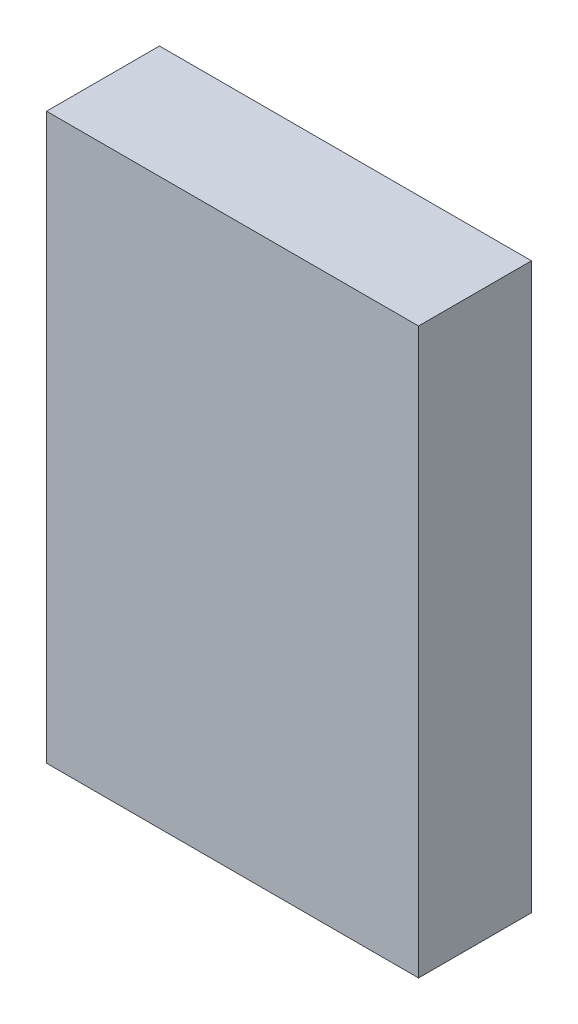
ISO-10303-21;
HEADER;
FILE_DESCRIPTION(('STEP AP214'),'2;1');
FILE_NAME('part.step','',(''),(''),'','','');
FILE_SCHEMA(('AUTOMOTIVE_DESIGN { 1 0 10303 214 1 1 1 1 }'));
ENDSEC;
DATA;
#1=APPLICATION_CONTEXT('core data for automotive mechanical design processes');
#2=APPLICATION_PROTOCOL_DEFINITION('international standard','automotive_design',2000,#1);
#3=PRODUCT_CONTEXT('',#1,'mechanical');
#4=PRODUCT('Part','Part','',(#3));
#5=PRODUCT_RELATED_PRODUCT_CATEGORY('part','',(#4));
#6=PRODUCT_DEFINITION_FORMATION('','',#4);
#7=PRODUCT_DEFINITION_CONTEXT('part definition',#1,'design');
#8=PRODUCT_DEFINITION('design','',#6,#7);
#9=PRODUCT_DEFINITION_SHAPE('','',#8);
#10=(LENGTH_UNIT() NAMED_UNIT(*) SI_UNIT(.MILLI.,.METRE.));
#11=(NAMED_UNIT(*) PLANE_ANGLE_UNIT() SI_UNIT($,.RADIAN.));
#12=(NAMED_UNIT(*) SI_UNIT($,.STERADIAN.) SOLID_ANGLE_UNIT());
#13=UNCERTAINTY_MEASURE_WITH_UNIT(LENGTH_MEASURE(1.E-05),#10,'distance_accuracy_value','');
#14=(GEOMETRIC_REPRESENTATION_CONTEXT(3) GLOBAL_UNCERTAINTY_ASSIGNED_CONTEXT((#13)) GLOBAL_UNIT_ASSIGNED_CONTEXT((#10,
#11,#12)) REPRESENTATION_CONTEXT('',''));
#15=CARTESIAN_POINT('',(0.,0.,0.));
#16=DIRECTION('',(0.,0.,1.));
#17=DIRECTION('',(1.,0.,0.));
#18=AXIS2_PLACEMENT_3D('',#15,#16,#17);
#19=CARTESIAN_POINT('',(28.,-42.5,17.));
#20=DIRECTION('',(-1.,0.,0.));
#21=DIRECTION('',(0.,0.,1.));
#22=AXIS2_PLACEMENT_3D('',#19,#20,#21);
#23=PLANE('',#22);
#24=DIRECTION('',(0.,1.,0.));
#25=VECTOR('',#24,1.);
#26=CARTESIAN_POINT('',(28.,-42.5,0.));
#27=LINE('',#26,#25);
#28=CARTESIAN_POINT('',(28.,-42.5,0.));
#29=VERTEX_POINT('',#28);
#30=CARTESIAN_POINT('',(28.,42.5,0.));
#31=VERTEX_POINT('',#30);
#32=EDGE_CURVE('E111',#29,#31,#27,.T.);
#33=ORIENTED_EDGE('',*,*,#32,.T.);
#34=DIRECTION('',(0.,0.,-1.));
#35=VECTOR('',#34,1.);
#36=CARTESIAN_POINT('',(28.,42.5,17.));
#37=LINE('',#36,#35);
#38=CARTESIAN_POINT('',(28.,42.5,17.));
#39=VERTEX_POINT('',#38);
#40=EDGE_CURVE('E11',#39,#31,#37,.T.);
#41=ORIENTED_EDGE('',*,*,#40,.F.);
#42=DIRECTION('',(0.,1.,0.));
#43=VECTOR('',#42,1.);
#44=CARTESIAN_POINT('',(28.,-42.5,17.));
#45=LINE('',#44,#43);
#46=CARTESIAN_POINT('',(28.,-42.5,17.));
#47=VERTEX_POINT('',#46);
#48=EDGE_CURVE('E95',#47,#39,#45,.T.);
#49=ORIENTED_EDGE('',*,*,#48,.F.);
#50=DIRECTION('',(0.,0.,-1.));
#51=VECTOR('',#50,1.);
#52=CARTESIAN_POINT('',(28.,-42.5,17.));
#53=LINE('',#52,#51);
#54=EDGE_CURVE('E107',#47,#29,#53,.T.);
#55=ORIENTED_EDGE('',*,*,#54,.T.);
#56=EDGE_LOOP('',(#33,#41,#49,#55));
#57=FACE_BOUND('',#56,.T.);
#58=ADVANCED_FACE('F43',(#57),#23,.F.);
#59=CARTESIAN_POINT('',(-28.,42.5,17.));
#60=DIRECTION('',(0.,-1.,0.));
#61=DIRECTION('',(0.,0.,-1.));
#62=AXIS2_PLACEMENT_3D('',#59,#60,#61);
#63=PLANE('',#62);
#64=DIRECTION('',(-1.,0.,0.));
#65=VECTOR('',#64,1.);
#66=CARTESIAN_POINT('',(-28.,42.5,0.));
#67=LINE('',#66,#65);
#68=CARTESIAN_POINT('',(-28.,42.5,0.));
#69=VERTEX_POINT('',#68);
#70=EDGE_CURVE('E100',#31,#69,#67,.T.);
#71=ORIENTED_EDGE('',*,*,#70,.T.);
#72=DIRECTION('',(0.,0.,-1.));
#73=VECTOR('',#72,1.);
#74=CARTESIAN_POINT('',(-28.,42.5,17.));
#75=LINE('',#74,#73);
#76=CARTESIAN_POINT('',(-28.,42.5,17.));
#77=VERTEX_POINT('',#76);
#78=EDGE_CURVE('E52',#77,#69,#75,.T.);
#79=ORIENTED_EDGE('',*,*,#78,.F.);
#80=DIRECTION('',(-1.,0.,0.));
#81=VECTOR('',#80,1.);
#82=CARTESIAN_POINT('',(-28.,42.5,17.));
#83=LINE('',#82,#81);
#84=EDGE_CURVE('E90',#39,#77,#83,.T.);
#85=ORIENTED_EDGE('',*,*,#84,.F.);
#86=ORIENTED_EDGE('',*,*,#40,.T.);
#87=EDGE_LOOP('',(#71,#79,#85,#86));
#88=FACE_BOUND('',#87,.T.);
#89=ADVANCED_FACE('F99',(#88),#63,.F.);
#90=CARTESIAN_POINT('',(-28.,-42.5,17.));
#91=DIRECTION('',(1.,0.,0.));
#92=DIRECTION('',(0.,0.,-1.));
#93=AXIS2_PLACEMENT_3D('',#90,#91,#92);
#94=PLANE('',#93);
#95=DIRECTION('',(0.,-1.,0.));
#96=VECTOR('',#95,1.);
#97=CARTESIAN_POINT('',(-28.,-42.5,0.));
#98=LINE('',#97,#96);
#99=CARTESIAN_POINT('',(-28.,-42.5,0.));
#100=VERTEX_POINT('',#99);
#101=EDGE_CURVE('E77',#69,#100,#98,.T.);
#102=ORIENTED_EDGE('',*,*,#101,.T.);
#103=DIRECTION('',(0.,0.,-1.));
#104=VECTOR('',#103,1.);
#105=CARTESIAN_POINT('',(-28.,-42.5,17.));
#106=LINE('',#105,#104);
#107=CARTESIAN_POINT('',(-28.,-42.5,17.));
#108=VERTEX_POINT('',#107);
#109=EDGE_CURVE('E102',#108,#100,#106,.T.);
#110=ORIENTED_EDGE('',*,*,#109,.F.);
#111=DIRECTION('',(0.,-1.,0.));
#112=VECTOR('',#111,1.);
#113=CARTESIAN_POINT('',(-28.,-42.5,17.));
#114=LINE('',#113,#112);
#115=EDGE_CURVE('E93',#77,#108,#114,.T.);
#116=ORIENTED_EDGE('',*,*,#115,.F.);
#117=ORIENTED_EDGE('',*,*,#78,.T.);
#118=EDGE_LOOP('',(#102,#110,#116,#117));
#119=FACE_BOUND('',#118,.T.);
#120=ADVANCED_FACE('F103',(#119),#94,.F.);
#121=CARTESIAN_POINT('',(-28.,-42.5,17.));
#122=DIRECTION('',(0.,1.,0.));
#123=DIRECTION('',(0.,0.,1.));
#124=AXIS2_PLACEMENT_3D('',#121,#122,#123);
#125=PLANE('',#124);
#126=DIRECTION('',(1.,0.,0.));
#127=VECTOR('',#126,1.);
#128=CARTESIAN_POINT('',(-28.,-42.5,0.));
#129=LINE('',#128,#127);
#130=EDGE_CURVE('E83',#100,#29,#129,.T.);
#131=ORIENTED_EDGE('',*,*,#130,.T.);
#132=ORIENTED_EDGE('',*,*,#54,.F.);
#133=DIRECTION('',(1.,0.,0.));
#134=VECTOR('',#133,1.);
#135=CARTESIAN_POINT('',(-28.,-42.5,17.));
#136=LINE('',#135,#134);
#137=EDGE_CURVE('E60',#108,#47,#136,.T.);
#138=ORIENTED_EDGE('',*,*,#137,.F.);
#139=ORIENTED_EDGE('',*,*,#109,.T.);
#140=EDGE_LOOP('',(#131,#132,#138,#139));
#141=FACE_BOUND('',#140,.T.);
#142=ADVANCED_FACE('F124',(#141),#125,.F.);
#143=CARTESIAN_POINT('',(0.,0.,17.));
#144=DIRECTION('',(0.,0.,-1.));
#145=DIRECTION('',(-1.,0.,0.));
#146=AXIS2_PLACEMENT_3D('',#143,#144,#145);
#147=PLANE('',#146);
#148=ORIENTED_EDGE('',*,*,#48,.T.);
#149=ORIENTED_EDGE('',*,*,#84,.T.);
#150=ORIENTED_EDGE('',*,*,#115,.T.);
#151=ORIENTED_EDGE('',*,*,#137,.T.);
#152=EDGE_LOOP('',(#148,#149,#150,#151));
#153=FACE_BOUND('',#152,.T.);
#154=ADVANCED_FACE('F91',(#153),#147,.F.);
#155=CARTESIAN_POINT('',(0.,0.,0.));
#156=DIRECTION('',(0.,0.,-1.));
#157=DIRECTION('',(-1.,0.,0.));
#158=AXIS2_PLACEMENT_3D('',#155,#156,#157);
#159=PLANE('',#158);
#160=ORIENTED_EDGE('',*,*,#32,.F.);
#161=ORIENTED_EDGE('',*,*,#130,.F.);
#162=ORIENTED_EDGE('',*,*,#101,.F.);
#163=ORIENTED_EDGE('',*,*,#70,.F.);
#164=EDGE_LOOP('',(#160,#161,#162,#163));
#165=FACE_BOUND('',#164,.T.);
#166=ADVANCED_FACE('F127',(#165),#159,.T.);
#167=CLOSED_SHELL('',(#58,#89,#120,#142,#154,#166));
#168=MANIFOLD_SOLID_BREP('B2',#167);
#169=ADVANCED_BREP_SHAPE_REPRESENTATION('',(#18,#168),#14);
#170=SHAPE_DEFINITION_REPRESENTATION(#9,#169);
ENDSEC;
END-ISO-10303-21;
